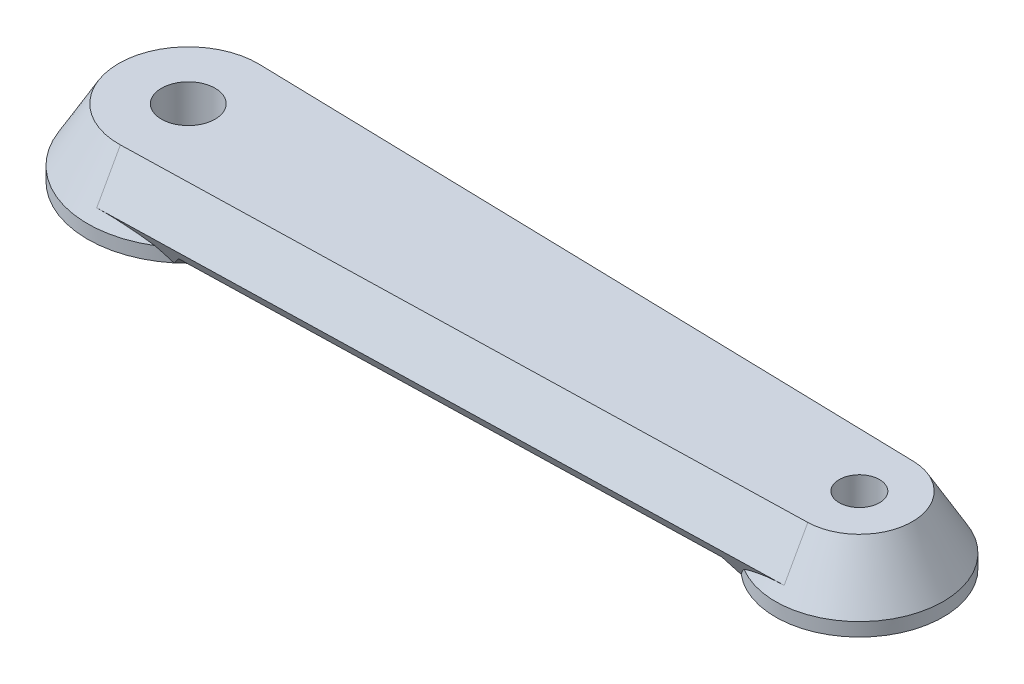
ISO-10303-21;
HEADER;
FILE_DESCRIPTION(('STEP AP214'),'2;1');
FILE_NAME('part.step','',(''),(''),'','','');
FILE_SCHEMA(('AUTOMOTIVE_DESIGN { 1 0 10303 214 1 1 1 1 }'));
ENDSEC;
DATA;
#1=APPLICATION_CONTEXT('core data for automotive mechanical design processes');
#2=APPLICATION_PROTOCOL_DEFINITION('international standard','automotive_design',2000,#1);
#3=PRODUCT_CONTEXT('',#1,'mechanical');
#4=PRODUCT('Part','Part','',(#3));
#5=PRODUCT_RELATED_PRODUCT_CATEGORY('part','',(#4));
#6=PRODUCT_DEFINITION_FORMATION('','',#4);
#7=PRODUCT_DEFINITION_CONTEXT('part definition',#1,'design');
#8=PRODUCT_DEFINITION('design','',#6,#7);
#9=PRODUCT_DEFINITION_SHAPE('','',#8);
#10=(LENGTH_UNIT() NAMED_UNIT(*) SI_UNIT(.MILLI.,.METRE.));
#11=(NAMED_UNIT(*) PLANE_ANGLE_UNIT() SI_UNIT($,.RADIAN.));
#12=(NAMED_UNIT(*) SI_UNIT($,.STERADIAN.) SOLID_ANGLE_UNIT());
#13=UNCERTAINTY_MEASURE_WITH_UNIT(LENGTH_MEASURE(1.E-05),#10,'distance_accuracy_value','');
#14=(GEOMETRIC_REPRESENTATION_CONTEXT(3) GLOBAL_UNCERTAINTY_ASSIGNED_CONTEXT((#13)) GLOBAL_UNIT_ASSIGNED_CONTEXT((#10,
#11,#12)) REPRESENTATION_CONTEXT('',''));
#15=CARTESIAN_POINT('',(0.,0.,0.));
#16=DIRECTION('',(0.,0.,1.));
#17=DIRECTION('',(1.,0.,0.));
#18=AXIS2_PLACEMENT_3D('',#15,#16,#17);
#19=CARTESIAN_POINT('',(0.,10.,0.));
#20=DIRECTION('',(0.,-1.,0.));
#21=DIRECTION('',(0.,0.,-1.));
#22=AXIS2_PLACEMENT_3D('',#19,#20,#21);
#23=CYLINDRICAL_SURFACE('',#22,75.);
#24=CARTESIAN_POINT('',(0.,10.,0.));
#25=DIRECTION('',(0.,1.,0.));
#26=DIRECTION('',(0.,0.,1.));
#27=AXIS2_PLACEMENT_3D('',#24,#25,#26);
#28=CIRCLE('',#27,75.);
#29=CARTESIAN_POINT('',(39.0298793608533,10.,-64.0442699784863));
#30=VERTEX_POINT('',#29);
#31=CARTESIAN_POINT('',(39.0298793608534,10.,64.0442699784863));
#32=VERTEX_POINT('',#31);
#33=EDGE_CURVE('E255',#30,#32,#28,.T.);
#34=ORIENTED_EDGE('',*,*,#33,.F.);
#35=CARTESIAN_POINT('',(0.,-102.583302491977,0.));
#36=DIRECTION('',(0.021650635094611,-0.500000000000001,-0.865754728546139));
#37=DIRECTION('',(-0.0125,-0.866025403784438,0.499843725578306));
#38=AXIS2_PLACEMENT_3D('',#35,#36,#37);
#39=ELLIPSE('',#38,150.,75.);
#40=CARTESIAN_POINT('',(47.4795619070681,0.,-58.0576541130702));
#41=VERTEX_POINT('',#40);
#42=EDGE_CURVE('E64',#30,#41,#39,.T.);
#43=ORIENTED_EDGE('',*,*,#42,.T.);
#44=CARTESIAN_POINT('',(0.,0.,0.));
#45=DIRECTION('',(0.,1.,0.));
#46=DIRECTION('',(0.,0.,1.));
#47=AXIS2_PLACEMENT_3D('',#44,#45,#46);
#48=CIRCLE('',#47,75.);
#49=CARTESIAN_POINT('',(47.4795619070682,0.,58.05765411307));
#50=VERTEX_POINT('',#49);
#51=EDGE_CURVE('E152',#41,#50,#48,.T.);
#52=ORIENTED_EDGE('',*,*,#51,.T.);
#53=CARTESIAN_POINT('',(0.,-102.583302491977,0.));
#54=DIRECTION('',(0.021650635094611,-0.500000000000001,0.865754728546139));
#55=DIRECTION('',(-0.0125,-0.866025403784438,-0.499843725578306));
#56=AXIS2_PLACEMENT_3D('',#53,#54,#55);
#57=ELLIPSE('',#56,150.,75.);
#58=EDGE_CURVE('E258',#50,#32,#57,.T.);
#59=ORIENTED_EDGE('',*,*,#58,.T.);
#60=EDGE_LOOP('',(#34,#43,#52,#59));
#61=FACE_BOUND('',#60,.T.);
#62=ADVANCED_FACE('F42',(#61),#23,.T.);
#63=CARTESIAN_POINT('',(0.,0.,0.));
#64=DIRECTION('',(0.,1.,0.));
#65=DIRECTION('',(0.,0.,1.));
#66=AXIS2_PLACEMENT_3D('',#63,#64,#65);
#67=PLANE('',#66);
#68=CARTESIAN_POINT('',(0.,0.,0.));
#69=DIRECTION('',(0.,1.,0.));
#70=DIRECTION('',(0.,0.,1.));
#71=AXIS2_PLACEMENT_3D('',#68,#69,#70);
#72=CIRCLE('',#71,20.);
#73=CARTESIAN_POINT('',(0.,0.,20.));
#74=VERTEX_POINT('',#73);
#75=EDGE_CURVE('E173',#74,#74,#72,.T.);
#76=ORIENTED_EDGE('',*,*,#75,.T.);
#77=EDGE_LOOP('',(#76));
#78=FACE_BOUND('',#77,.T.);
#79=EDGE_CURVE('E155',#50,#41,#48,.T.);
#80=ORIENTED_EDGE('',*,*,#79,.F.);
#81=ORIENTED_EDGE('',*,*,#51,.F.);
#82=EDGE_LOOP('',(#80,#81));
#83=FACE_BOUND('',#82,.T.);
#84=ADVANCED_FACE('F248',(#78,#83),#67,.F.);
#85=CARTESIAN_POINT('',(0.,10.,0.));
#86=DIRECTION('',(0.,1.,0.));
#87=DIRECTION('',(0.,0.,1.));
#88=AXIS2_PLACEMENT_3D('',#85,#86,#87);
#89=PLANE('',#88);
#90=DIRECTION('',(0.99968745115661,0.,0.025));
#91=VECTOR('',#90,1.);
#92=CARTESIAN_POINT('',(1.625,10.,-64.9796843251797));
#93=LINE('',#92,#91);
#94=CARTESIAN_POINT('',(56.3801367453318,10.,-63.6103779314168));
#95=VERTEX_POINT('',#94);
#96=CARTESIAN_POINT('',(451.328127442169,10.,-53.7335911857221));
#97=VERTEX_POINT('',#96);
#98=EDGE_CURVE('E176',#95,#97,#93,.T.);
#99=ORIENTED_EDGE('',*,*,#98,.T.);
#100=CARTESIAN_POINT('',(500.,10.,0.));
#101=DIRECTION('',(0.,1.,0.));
#102=DIRECTION('',(0.,0.,1.));
#103=AXIS2_PLACEMENT_3D('',#100,#101,#102);
#104=CIRCLE('',#103,72.5000000000001);
#105=CARTESIAN_POINT('',(451.328127442169,10.,53.7335911857221));
#106=VERTEX_POINT('',#105);
#107=EDGE_CURVE('E298',#97,#106,#104,.T.);
#108=ORIENTED_EDGE('',*,*,#107,.T.);
#109=DIRECTION('',(-0.99968745115661,0.,0.025));
#110=VECTOR('',#109,1.);
#111=CARTESIAN_POINT('',(1.625,10.,64.9796843251797));
#112=LINE('',#111,#110);
#113=CARTESIAN_POINT('',(56.3801367453318,10.,63.6103779314168));
#114=VERTEX_POINT('',#113);
#115=EDGE_CURVE('E179',#106,#114,#112,.T.);
#116=ORIENTED_EDGE('',*,*,#115,.T.);
#117=CARTESIAN_POINT('',(0.,10.,0.));
#118=DIRECTION('',(0.,1.,0.));
#119=DIRECTION('',(0.,0.,1.));
#120=AXIS2_PLACEMENT_3D('',#117,#118,#119);
#121=CIRCLE('',#120,85.);
#122=EDGE_CURVE('E263',#114,#95,#121,.T.);
#123=ORIENTED_EDGE('',*,*,#122,.T.);
#124=EDGE_LOOP('',(#99,#108,#116,#123));
#125=FACE_BOUND('',#124,.T.);
#126=ADVANCED_FACE('F253',(#125),#89,.F.);
#127=CARTESIAN_POINT('',(0.,10.,0.));
#128=DIRECTION('',(0.,-1.,0.));
#129=DIRECTION('',(0.,0.,1.));
#130=AXIS2_PLACEMENT_3D('',#127,#128,#129);
#131=CONICAL_SURFACE('',#130,75.,0.5235987755983);
#132=ORIENTED_EDGE('',*,*,#33,.T.);
#133=CARTESIAN_POINT('',(39.0298793608534,10.,64.0442699784863));
#134=CARTESIAN_POINT('',(38.0966256087769,10.43505847696,64.3188682764547));
#135=CARTESIAN_POINT('',(37.1552648024323,10.8573881594754,64.5863180436157));
#136=CARTESIAN_POINT('',(35.2564715687795,11.6748710838556,65.1059242632289));
#137=CARTESIAN_POINT('',(34.2990365222441,12.070019842175,65.3580781917966));
#138=CARTESIAN_POINT('',(32.3670461382462,12.8318686150163,65.8463841649454));
#139=CARTESIAN_POINT('',(31.3924665298006,13.1985235117224,66.0825107595635));
#140=CARTESIAN_POINT('',(29.4282116571537,13.9008425106955,66.5372433206298));
#141=CARTESIAN_POINT('',(28.4385372148285,14.2365082932735,66.755850236956));
#142=CARTESIAN_POINT('',(26.4650644366187,14.8685273603042,67.170212943479));
#143=CARTESIAN_POINT('',(25.4815569932161,15.165542112825,67.3663434772568));
#144=CARTESIAN_POINT('',(23.5015927353855,15.7263814558718,67.7397600402976));
#145=CARTESIAN_POINT('',(22.5051362384407,15.9902068584423,67.9170465306019));
#146=CARTESIAN_POINT('',(20.5010521413008,16.4828737999921,68.2516946182277));
#147=CARTESIAN_POINT('',(19.4934330106296,16.7117401427374,68.4090703286832));
#148=CARTESIAN_POINT('',(17.4677317059169,17.1331865766022,68.7031269804082));
#149=CARTESIAN_POINT('',(16.449650514163,17.3257700420977,68.8398098459189));
#150=CARTESIAN_POINT('',(14.3090382865125,17.6895396259296,69.1034300129368));
#151=CARTESIAN_POINT('',(13.1856206567094,17.8570554407307,69.2282697729734));
#152=CARTESIAN_POINT('',(10.9303019535446,18.1456490458501,69.451342057139));
#153=CARTESIAN_POINT('',(9.79840151792611,18.2667302921437,69.5495765612516));
#154=CARTESIAN_POINT('',(7.51569345886579,18.4624542932379,69.7196987389366));
#155=CARTESIAN_POINT('',(6.36481614666029,18.5365610932669,69.7912786248978));
#156=CARTESIAN_POINT('',(4.63585984151394,18.6107395148713,69.8773563677068));
#157=CARTESIAN_POINT('',(4.05903322829362,18.6293020330475,69.9025019671312));
#158=CARTESIAN_POINT('',(2.90484242122852,18.6540608054182,69.9456647116667));
#159=CARTESIAN_POINT('',(2.32747822200494,18.6602569345219,69.9636817846686));
#160=CARTESIAN_POINT('',(1.75000000000001,18.6602540378443,69.9781215809627));
#161=B_SPLINE_CURVE_WITH_KNOTS('',3,(#133,#134,#135,#136,#137,#138,#139,#140,#141,#142,#143,
#144,#145,#146,#147,#148,#149,#150,#151,#152,#153,#154,#155,#156,#157,#158,#159,#160),
.UNSPECIFIED.,.F.,.F.,(4,2,2,2,2,2,2,2,2,2,2,2,2,4),(0.,3.19695606092177,6.39443820751428,
9.59688430844946,12.7991566622467,15.9362046485129,19.0731758656129,22.2079109305702,
25.3423543151777,28.7691052912586,32.1956011757976,35.6605194918706,37.3933850600468,
39.1262681567528),.UNSPECIFIED.);
#162=CARTESIAN_POINT('',(1.75000000000001,18.6602540378443,69.9781215809627));
#163=VERTEX_POINT('',#162);
#164=EDGE_CURVE('E151',#32,#163,#161,.T.);
#165=ORIENTED_EDGE('',*,*,#164,.T.);
#166=DIRECTION('',(0.0125,-0.866025403784438,0.499843725578306));
#167=VECTOR('',#166,1.);
#168=CARTESIAN_POINT('',(1.87500000000001,10.,74.9765588367458));
#169=LINE('',#168,#167);
#170=CARTESIAN_POINT('',(1.29764973081038,50.,51.8897660755153));
#171=VERTEX_POINT('',#170);
#172=EDGE_CURVE('E130',#171,#163,#169,.T.);
#173=ORIENTED_EDGE('',*,*,#172,.F.);
#174=CARTESIAN_POINT('',(0.,50.,0.));
#175=DIRECTION('',(0.,1.,0.));
#176=DIRECTION('',(0.,0.,1.));
#177=AXIS2_PLACEMENT_3D('',#174,#175,#176);
#178=CIRCLE('',#177,51.9059892324149);
#179=CARTESIAN_POINT('',(1.29764973081036,50.,-51.8897660755153));
#180=VERTEX_POINT('',#179);
#181=EDGE_CURVE('E137',#180,#171,#178,.T.);
#182=ORIENTED_EDGE('',*,*,#181,.F.);
#183=DIRECTION('',(0.0124999999999999,-0.866025403784438,-0.499843725578306));
#184=VECTOR('',#183,1.);
#185=CARTESIAN_POINT('',(1.87499999999998,10.,-74.9765588367458));
#186=LINE('',#185,#184);
#187=CARTESIAN_POINT('',(1.74999999999998,18.6602540378443,-69.9781215809627));
#188=VERTEX_POINT('',#187);
#189=EDGE_CURVE('E162',#180,#188,#186,.T.);
#190=ORIENTED_EDGE('',*,*,#189,.T.);
#191=CARTESIAN_POINT('',(1.74999999999998,18.6602540378443,-69.9781215809627));
#192=CARTESIAN_POINT('',(2.2495150492895,18.6602556728977,-69.9656307447326));
#193=CARTESIAN_POINT('',(2.74894743623502,18.6556203138964,-69.9504639689335));
#194=CARTESIAN_POINT('',(3.74744783227952,18.6370932781913,-69.9147937212861));
#195=CARTESIAN_POINT('',(4.24651584285561,18.6232016392216,-69.8942902711935));
#196=CARTESIAN_POINT('',(5.74276793969893,18.5676729409658,-69.8248027416397));
#197=CARTESIAN_POINT('',(6.73911324642626,18.5121820924751,-69.7678386485965));
#198=CARTESIAN_POINT('',(8.72692473547793,18.364707601232,-69.6329567669762));
#199=CARTESIAN_POINT('',(9.71839386637799,18.2727497556149,-69.5550538033015));
#200=CARTESIAN_POINT('',(11.6955200761154,18.0529921857793,-69.3786934347277));
#201=CARTESIAN_POINT('',(12.6811771285954,17.9251922991475,-69.2802359366893));
#202=CARTESIAN_POINT('',(14.6278034017393,17.6371866478731,-69.0652229375051));
#203=CARTESIAN_POINT('',(15.5889017670897,17.4775909762614,-68.9490165542342));
#204=CARTESIAN_POINT('',(17.5026301489284,17.1256679134164,-68.6979119871786));
#205=CARTESIAN_POINT('',(18.4552600342228,16.9333400160211,-68.5630135143507));
#206=CARTESIAN_POINT('',(20.3508169928094,16.5171214539281,-68.2752307453483));
#207=CARTESIAN_POINT('',(21.2937443552694,16.2932317328192,-68.122346986894));
#208=CARTESIAN_POINT('',(23.168844201399,15.8151773362009,-67.7993637081156));
#209=CARTESIAN_POINT('',(24.1010171258474,15.561013906352,-67.6292648961761));
#210=CARTESIAN_POINT('',(26.2301613169441,14.9436152391468,-67.2194529184308));
#211=CARTESIAN_POINT('',(27.4231836622604,14.5704587379947,-66.9741086713472));
#212=CARTESIAN_POINT('',(29.7880452461698,13.7785327805174,-66.4576070350326));
#213=CARTESIAN_POINT('',(30.9598875480888,13.3597699829101,-66.1864534148091));
#214=CARTESIAN_POINT('',(33.2952391887912,12.474522960917,-65.6167939709442));
#215=CARTESIAN_POINT('',(34.4584870310655,12.0075339319938,-65.3180031466033));
#216=CARTESIAN_POINT('',(36.7617464496265,11.033224328476,-64.6977098773304));
#217=CARTESIAN_POINT('',(37.9017593372312,10.5259060379188,-64.376208718707));
#218=CARTESIAN_POINT('',(39.0298793608534,10.,-64.0442699784863));
#219=B_SPLINE_CURVE_WITH_KNOTS('',3,(#191,#192,#193,#194,#195,#196,#197,#198,#199,#200,#201,
#202,#203,#204,#205,#206,#207,#208,#209,#210,#211,#212,#213,#214,#215,#216,#217,#218),
.UNSPECIFIED.,.F.,.F.,(4,2,2,2,2,2,2,2,2,2,2,2,2,4),(0.,1.49895361057675,2.9979011105484,
5.99545681952691,8.99089579811997,11.9863483503418,14.9290677655218,17.8718326902287,
20.8145096551453,23.7570655806543,27.5772932701795,31.3969639356934,35.2617067386256,
39.1262308185799),.UNSPECIFIED.);
#220=EDGE_CURVE('E260',#188,#30,#219,.T.);
#221=ORIENTED_EDGE('',*,*,#220,.T.);
#222=EDGE_LOOP('',(#132,#165,#173,#182,#190,#221));
#223=FACE_BOUND('',#222,.T.);
#224=ADVANCED_FACE('F149',(#223),#131,.T.);
#225=CARTESIAN_POINT('',(1.87500000000001,10.,74.9765588367458));
#226=DIRECTION('',(0.021650635094611,0.500000000000001,0.865754728546139));
#227=DIRECTION('',(0.,-0.86595771117451,0.500117228714831));
#228=AXIS2_PLACEMENT_3D('',#225,#226,#227);
#229=PLANE('',#228);
#230=ORIENTED_EDGE('',*,*,#172,.T.);
#231=DIRECTION('',(-0.99968745115661,0.,0.025));
#232=VECTOR('',#231,1.);
#233=CARTESIAN_POINT('',(1.75000000000001,18.6602540378443,69.9781215809627));
#234=LINE('',#233,#232);
#235=CARTESIAN_POINT('',(501.4375,18.6602540378443,57.4820284415051));
#236=VERTEX_POINT('',#235);
#237=EDGE_CURVE('E169',#163,#236,#234,.F.);
#238=ORIENTED_EDGE('',*,*,#237,.T.);
#239=DIRECTION('',(0.0125000000000002,-0.866025403784438,0.499843725578306));
#240=VECTOR('',#239,1.);
#241=CARTESIAN_POINT('',(501.5625,10.,62.4804656972881));
#242=LINE('',#241,#240);
#243=CARTESIAN_POINT('',(500.98514973081,50.,39.3936729360577));
#244=VERTEX_POINT('',#243);
#245=EDGE_CURVE('E133',#244,#236,#242,.T.);
#246=ORIENTED_EDGE('',*,*,#245,.F.);
#247=DIRECTION('',(-0.99968745115661,0.,0.025));
#248=VECTOR('',#247,1.);
#249=CARTESIAN_POINT('',(1.29764973081038,50.,51.8897660755153));
#250=LINE('',#249,#248);
#251=EDGE_CURVE('E125',#171,#244,#250,.F.);
#252=ORIENTED_EDGE('',*,*,#251,.F.);
#253=EDGE_LOOP('',(#230,#238,#246,#252));
#254=FACE_BOUND('',#253,.T.);
#255=ADVANCED_FACE('F127',(#254),#229,.T.);
#256=CARTESIAN_POINT('',(500.,10.,0.));
#257=DIRECTION('',(0.,-1.,0.));
#258=DIRECTION('',(0.,0.,1.));
#259=AXIS2_PLACEMENT_3D('',#256,#257,#258);
#260=CONICAL_SURFACE('',#259,62.5,0.5235987755983);
#261=CARTESIAN_POINT('',(500.,10.,0.));
#262=DIRECTION('',(0.,1.,0.));
#263=DIRECTION('',(0.,0.,1.));
#264=AXIS2_PLACEMENT_3D('',#261,#262,#263);
#265=CIRCLE('',#264,62.5);
#266=CARTESIAN_POINT('',(467.411449131332,10.,53.3313824336128));
#267=VERTEX_POINT('',#266);
#268=CARTESIAN_POINT('',(467.411449131332,10.,-53.3313824336127));
#269=VERTEX_POINT('',#268);
#270=EDGE_CURVE('E146',#267,#269,#265,.T.);
#271=ORIENTED_EDGE('',*,*,#270,.T.);
#272=CARTESIAN_POINT('',(467.411449131332,10.,-53.3313824336127));
#273=CARTESIAN_POINT('',(468.181400032664,10.390486632535,-53.537645690831));
#274=CARTESIAN_POINT('',(468.957812492336,10.7711624197198,-53.7380812934601));
#275=CARTESIAN_POINT('',(470.523834916271,11.511600901294,-54.1265445032438));
#276=CARTESIAN_POINT('',(471.313447986054,11.8713585828353,-54.3145691376621));
#277=CARTESIAN_POINT('',(473.703955418983,12.9179239741499,-54.8592114895761));
#278=CARTESIAN_POINT('',(475.324572732167,13.5710301600044,-55.1958723119097));
#279=CARTESIAN_POINT('',(477.773929529012,14.4671043659098,-55.6521296786942));
#280=CARTESIAN_POINT('',(478.58434497421,14.7491738533315,-55.7947667681146));
#281=CARTESIAN_POINT('',(480.216280263219,15.2872961443724,-56.0647378146172));
#282=CARTESIAN_POINT('',(481.037799234512,15.5433509789145,-56.1920729664395));
#283=CARTESIAN_POINT('',(482.690761231717,16.0278483966865,-56.4305481662295));
#284=CARTESIAN_POINT('',(483.522198395636,16.2563064805984,-56.5416973129139));
#285=CARTESIAN_POINT('',(485.194479268091,16.6843603071251,-56.7470914787844));
#286=CARTESIAN_POINT('',(486.035322389566,16.8839578403265,-56.8413375467704));
#287=CARTESIAN_POINT('',(488.06166398151,17.3264024707131,-57.0461885593741));
#288=CARTESIAN_POINT('',(489.251199334364,17.5548661393843,-57.1483856777512));
#289=CARTESIAN_POINT('',(491.643100122199,17.9496205345182,-57.3165522746251));
#290=CARTESIAN_POINT('',(492.845464724788,18.1159152697184,-57.3825240891073));
#291=CARTESIAN_POINT('',(494.664541029738,18.3179100179609,-57.4536911469379));
#292=CARTESIAN_POINT('',(495.278151138526,18.3775979473472,-57.4728177143032));
#293=CARTESIAN_POINT('',(496.507024636348,18.4801027434725,-57.5012859462068));
#294=CARTESIAN_POINT('',(497.122288017682,18.522919688641,-57.510627656233));
#295=CARTESIAN_POINT('',(498.354027637161,18.5915092422186,-57.5194371163543));
#296=CARTESIAN_POINT('',(498.97050419906,18.6172764203271,-57.5189017221871));
#297=CARTESIAN_POINT('',(500.203860286034,18.6516551170028,-57.5079129352602));
#298=CARTESIAN_POINT('',(500.820739819676,18.6602662581603,-57.4974593243205));
#299=CARTESIAN_POINT('',(501.4375,18.6602540378443,-57.4820284415051));
#300=B_SPLINE_CURVE_WITH_KNOTS('',3,(#272,#273,#274,#275,#276,#277,#278,#279,#280,#281,#282,
#283,#284,#285,#286,#287,#288,#289,#290,#291,#292,#293,#294,#295,#296,#297,#298,#299),
.UNSPECIFIED.,.F.,.F.,(4,2,2,2,2,2,2,2,2,2,2,2,2,4),(0.,2.66257234451498,5.32578014442944,
10.6589244099262,13.2680887103055,15.8770491605733,18.4845373147377,21.0918636238017,
24.7364480886076,28.3807975050989,30.2309466806849,32.0810872552293,33.9318168108292,
35.7825870795399),.UNSPECIFIED.);
#301=CARTESIAN_POINT('',(501.4375,18.6602540378443,-57.4820284415051));
#302=VERTEX_POINT('',#301);
#303=EDGE_CURVE('E262',#269,#302,#300,.T.);
#304=ORIENTED_EDGE('',*,*,#303,.T.);
#305=DIRECTION('',(0.0125,-0.866025403784438,-0.499843725578306));
#306=VECTOR('',#305,1.);
#307=CARTESIAN_POINT('',(501.5625,10.,-62.4804656972882));
#308=LINE('',#307,#306);
#309=CARTESIAN_POINT('',(500.98514973081,50.,-39.3936729360577));
#310=VERTEX_POINT('',#309);
#311=EDGE_CURVE('E157',#310,#302,#308,.T.);
#312=ORIENTED_EDGE('',*,*,#311,.F.);
#313=CARTESIAN_POINT('',(500.,50.,0.));
#314=DIRECTION('',(0.,1.,0.));
#315=DIRECTION('',(0.,0.,1.));
#316=AXIS2_PLACEMENT_3D('',#313,#314,#315);
#317=CIRCLE('',#316,39.4059892324149);
#318=EDGE_CURVE('E136',#244,#310,#317,.T.);
#319=ORIENTED_EDGE('',*,*,#318,.F.);
#320=ORIENTED_EDGE('',*,*,#245,.T.);
#321=CARTESIAN_POINT('',(501.4375,18.6602540378443,57.4820284415051));
#322=CARTESIAN_POINT('',(500.61630085616,18.6602934925674,57.5025876250452));
#323=CARTESIAN_POINT('',(499.794891472621,18.6450106399218,57.5143029621598));
#324=CARTESIAN_POINT('',(498.153183859666,18.5840874747937,57.5201734815211));
#325=CARTESIAN_POINT('',(497.332885566588,18.5384489822814,57.5143297164486));
#326=CARTESIAN_POINT('',(495.695476646422,18.4171493135982,57.4852234459548));
#327=CARTESIAN_POINT('',(494.878364020743,18.3415117612519,57.4619746339994));
#328=CARTESIAN_POINT('',(493.248076298084,18.1607619477929,57.3983559896757));
#329=CARTESIAN_POINT('',(492.434901226126,18.0556494996134,57.3579860486447));
#330=CARTESIAN_POINT('',(490.829148244715,17.8189311778649,57.2614303080113));
#331=CARTESIAN_POINT('',(490.036471766179,17.6878643060379,57.2055582635006));
#332=CARTESIAN_POINT('',(488.457292641607,17.3988845302534,57.0781553706486));
#333=CARTESIAN_POINT('',(487.670790096219,17.2409711895901,57.0066242675791));
#334=CARTESIAN_POINT('',(486.104944805044,16.8992441949778,56.8484247824637));
#335=CARTESIAN_POINT('',(485.325602300417,16.7154296720189,56.7617558925067));
#336=CARTESIAN_POINT('',(483.775016953575,16.322965300597,56.5738723929195));
#337=CARTESIAN_POINT('',(483.003773966041,16.1143158985428,56.4726580447382));
#338=CARTESIAN_POINT('',(480.956098295885,15.5254657349203,56.1837868496543));
#339=CARTESIAN_POINT('',(479.687471346719,15.1240029746197,55.9836553397824));
#340=CARTESIAN_POINT('',(477.177514213064,14.2602821121631,55.5475985066209));
#341=CARTESIAN_POINT('',(475.936184468531,13.7980230309759,55.3116726069084));
#342=CARTESIAN_POINT('',(473.462339732786,12.8101345483181,54.8030020595189));
#343=CARTESIAN_POINT('',(472.230302800994,12.283590563581,54.5297172566365));
#344=CARTESIAN_POINT('',(469.79742633347,11.1790458073497,53.952649594152));
#345=CARTESIAN_POINT('',(468.596573815309,10.6010669072669,53.6488796906253));
#346=CARTESIAN_POINT('',(467.411449131332,9.99999999999999,53.3313824336127));
#347=B_SPLINE_CURVE_WITH_KNOTS('',3,(#321,#322,#323,#324,#325,#326,#327,#328,#329,#330,#331,
#332,#333,#334,#335,#336,#337,#338,#339,#340,#341,#342,#343,#344,#345,#346),.UNSPECIFIED.,.F.,
.F.,(4,2,2,2,2,2,2,2,2,2,2,2,4),(0.,2.46416246716391,4.92817720896451,7.39025541531648,
9.85234924797391,12.26785061702,14.6833912822724,17.0990130105823,19.5145913244638,
23.5489355919643,27.58334483433,31.6838881974717,35.7826961635627),.UNSPECIFIED.);
#348=EDGE_CURVE('E185',#236,#267,#347,.T.);
#349=ORIENTED_EDGE('',*,*,#348,.T.);
#350=EDGE_LOOP('',(#271,#304,#312,#319,#320,#349));
#351=FACE_BOUND('',#350,.T.);
#352=ADVANCED_FACE('F199',(#351),#260,.T.);
#353=CARTESIAN_POINT('',(1.875,10.,-74.9765588367458));
#354=DIRECTION('',(0.021650635094611,0.500000000000001,-0.865754728546139));
#355=DIRECTION('',(0.,0.86595771117451,0.500117228714831));
#356=AXIS2_PLACEMENT_3D('',#353,#354,#355);
#357=PLANE('',#356);
#358=ORIENTED_EDGE('',*,*,#311,.T.);
#359=DIRECTION('',(0.99968745115661,0.,0.025));
#360=VECTOR('',#359,1.);
#361=CARTESIAN_POINT('',(1.75,18.6602540378443,-69.9781215809627));
#362=LINE('',#361,#360);
#363=EDGE_CURVE('E182',#302,#188,#362,.F.);
#364=ORIENTED_EDGE('',*,*,#363,.T.);
#365=ORIENTED_EDGE('',*,*,#189,.F.);
#366=DIRECTION('',(0.99968745115661,0.,0.025));
#367=VECTOR('',#366,1.);
#368=CARTESIAN_POINT('',(1.29764973081037,50.,-51.8897660755153));
#369=LINE('',#368,#367);
#370=EDGE_CURVE('E142',#310,#180,#369,.F.);
#371=ORIENTED_EDGE('',*,*,#370,.F.);
#372=EDGE_LOOP('',(#358,#364,#365,#371));
#373=FACE_BOUND('',#372,.T.);
#374=ADVANCED_FACE('F278',(#373),#357,.T.);
#375=CARTESIAN_POINT('',(0.,50.,0.));
#376=DIRECTION('',(0.,1.,0.));
#377=DIRECTION('',(0.,0.,1.));
#378=AXIS2_PLACEMENT_3D('',#375,#376,#377);
#379=PLANE('',#378);
#380=CARTESIAN_POINT('',(0.,50.,0.));
#381=DIRECTION('',(0.,-1.,0.));
#382=DIRECTION('',(0.,0.,-1.));
#383=AXIS2_PLACEMENT_3D('',#380,#381,#382);
#384=CIRCLE('',#383,20.);
#385=CARTESIAN_POINT('',(0.,50.,-20.));
#386=VERTEX_POINT('',#385);
#387=EDGE_CURVE('E174',#386,#386,#384,.T.);
#388=ORIENTED_EDGE('',*,*,#387,.T.);
#389=EDGE_LOOP('',(#388));
#390=FACE_BOUND('',#389,.T.);
#391=CARTESIAN_POINT('',(500.,50.,0.));
#392=DIRECTION('',(0.,-1.,0.));
#393=DIRECTION('',(0.,0.,-1.));
#394=AXIS2_PLACEMENT_3D('',#391,#392,#393);
#395=CIRCLE('',#394,15.);
#396=CARTESIAN_POINT('',(500.,50.,-15.));
#397=VERTEX_POINT('',#396);
#398=EDGE_CURVE('E322',#397,#397,#395,.T.);
#399=ORIENTED_EDGE('',*,*,#398,.T.);
#400=EDGE_LOOP('',(#399));
#401=FACE_BOUND('',#400,.T.);
#402=ORIENTED_EDGE('',*,*,#181,.T.);
#403=ORIENTED_EDGE('',*,*,#251,.T.);
#404=ORIENTED_EDGE('',*,*,#318,.T.);
#405=ORIENTED_EDGE('',*,*,#370,.T.);
#406=EDGE_LOOP('',(#402,#403,#404,#405));
#407=FACE_BOUND('',#406,.T.);
#408=ADVANCED_FACE('F140',(#390,#401,#407),#379,.T.);
#409=CARTESIAN_POINT('',(500.,10.,0.));
#410=DIRECTION('',(0.,-1.,0.));
#411=DIRECTION('',(0.,0.,-1.));
#412=AXIS2_PLACEMENT_3D('',#409,#410,#411);
#413=CYLINDRICAL_SURFACE('',#412,62.5);
#414=ORIENTED_EDGE('',*,*,#270,.F.);
#415=CARTESIAN_POINT('',(500.,-80.9326673973659,0.));
#416=DIRECTION('',(0.021650635094611,-0.500000000000001,0.865754728546139));
#417=DIRECTION('',(-0.0125,-0.866025403784438,-0.499843725578306));
#418=AXIS2_PLACEMENT_3D('',#415,#416,#417);
#419=ELLIPSE('',#418,125.,62.5);
#420=CARTESIAN_POINT('',(459.673492334786,0.,47.7495840770097));
#421=VERTEX_POINT('',#420);
#422=EDGE_CURVE('E72',#267,#421,#419,.T.);
#423=ORIENTED_EDGE('',*,*,#422,.T.);
#424=CARTESIAN_POINT('',(500.,0.,0.));
#425=DIRECTION('',(0.,1.,0.));
#426=DIRECTION('',(0.,0.,1.));
#427=AXIS2_PLACEMENT_3D('',#424,#425,#426);
#428=CIRCLE('',#427,62.5);
#429=CARTESIAN_POINT('',(459.673492334786,0.,-47.7495840770097));
#430=VERTEX_POINT('',#429);
#431=EDGE_CURVE('E296',#421,#430,#428,.T.);
#432=ORIENTED_EDGE('',*,*,#431,.T.);
#433=CARTESIAN_POINT('',(500.,-80.9326673973659,0.));
#434=DIRECTION('',(0.021650635094611,-0.500000000000001,-0.865754728546139));
#435=DIRECTION('',(-0.0125,-0.866025403784438,0.499843725578306));
#436=AXIS2_PLACEMENT_3D('',#433,#434,#435);
#437=ELLIPSE('',#436,125.,62.5);
#438=EDGE_CURVE('E291',#430,#269,#437,.T.);
#439=ORIENTED_EDGE('',*,*,#438,.T.);
#440=EDGE_LOOP('',(#414,#423,#432,#439));
#441=FACE_BOUND('',#440,.T.);
#442=ADVANCED_FACE('F286',(#441),#413,.T.);
#443=CARTESIAN_POINT('',(500.,0.,0.));
#444=DIRECTION('',(0.,1.,0.));
#445=DIRECTION('',(0.,0.,1.));
#446=AXIS2_PLACEMENT_3D('',#443,#444,#445);
#447=PLANE('',#446);
#448=CARTESIAN_POINT('',(500.,0.,0.));
#449=DIRECTION('',(0.,1.,0.));
#450=DIRECTION('',(0.,0.,1.));
#451=AXIS2_PLACEMENT_3D('',#448,#449,#450);
#452=CIRCLE('',#451,15.);
#453=CARTESIAN_POINT('',(500.,0.,15.));
#454=VERTEX_POINT('',#453);
#455=EDGE_CURVE('E170',#454,#454,#452,.T.);
#456=ORIENTED_EDGE('',*,*,#455,.T.);
#457=EDGE_LOOP('',(#456));
#458=FACE_BOUND('',#457,.T.);
#459=EDGE_CURVE('E259',#430,#421,#428,.T.);
#460=ORIENTED_EDGE('',*,*,#459,.F.);
#461=ORIENTED_EDGE('',*,*,#431,.F.);
#462=EDGE_LOOP('',(#460,#461));
#463=FACE_BOUND('',#462,.T.);
#464=ADVANCED_FACE('F337',(#458,#463),#447,.F.);
#465=CARTESIAN_POINT('',(500.,50.,0.));
#466=DIRECTION('',(0.,-1.,0.));
#467=DIRECTION('',(0.,0.,-1.));
#468=AXIS2_PLACEMENT_3D('',#465,#466,#467);
#469=CYLINDRICAL_SURFACE('',#468,15.);
#470=ORIENTED_EDGE('',*,*,#398,.F.);
#471=EDGE_LOOP('',(#470));
#472=FACE_BOUND('',#471,.T.);
#473=ORIENTED_EDGE('',*,*,#455,.F.);
#474=EDGE_LOOP('',(#473));
#475=FACE_BOUND('',#474,.T.);
#476=ADVANCED_FACE('F331',(#472,#475),#469,.F.);
#477=CARTESIAN_POINT('',(0.,50.,0.));
#478=DIRECTION('',(0.,-1.,0.));
#479=DIRECTION('',(0.,0.,-1.));
#480=AXIS2_PLACEMENT_3D('',#477,#478,#479);
#481=CYLINDRICAL_SURFACE('',#480,20.);
#482=ORIENTED_EDGE('',*,*,#387,.F.);
#483=EDGE_LOOP('',(#482));
#484=FACE_BOUND('',#483,.T.);
#485=ORIENTED_EDGE('',*,*,#75,.F.);
#486=EDGE_LOOP('',(#485));
#487=FACE_BOUND('',#486,.T.);
#488=ADVANCED_FACE('F213',(#484,#487),#481,.F.);
#489=CARTESIAN_POINT('',(1.75000000000001,18.6602540378443,69.9781215809627));
#490=DIRECTION('',(0.021650635094611,-0.500000000000001,0.865754728546139));
#491=DIRECTION('',(-0.99968745115661,0.,0.025));
#492=AXIS2_PLACEMENT_3D('',#489,#490,#491);
#493=PLANE('',#492);
#494=ORIENTED_EDGE('',*,*,#164,.F.);
#495=ORIENTED_EDGE('',*,*,#58,.F.);
#496=CARTESIAN_POINT('',(47.4795619070681,1.97758476261356E-13,58.0576541130702));
#497=CARTESIAN_POINT('',(48.2269552561639,0.82955601497632,58.518057566464));
#498=CARTESIAN_POINT('',(48.9726974208842,1.66021948287701,58.9791419005197));
#499=CARTESIAN_POINT('',(50.4612320179051,3.32350459250783,59.9025152406481));
#500=CARTESIAN_POINT('',(51.2040244723994,4.15612621942933,60.3648042376133));
#501=CARTESIAN_POINT('',(52.6870225003576,5.82308225793724,61.2904361096452));
#502=CARTESIAN_POINT('',(53.4272280774567,6.65741666711421,61.7537789832294));
#503=CARTESIAN_POINT('',(54.9053389963792,8.32761271778634,62.6814042779243));
#504=CARTESIAN_POINT('',(55.6432443208366,9.16347437073651,63.1456867060849));
#505=CARTESIAN_POINT('',(56.3801367453318,10.,63.6103779314168));
#506=B_SPLINE_CURVE_WITH_KNOTS('',3,(#496,#497,#498,#499,#500,#501,#502,#503,#504,#505),
.UNSPECIFIED.,.F.,.F.,(4,2,2,2,4),(0.,3.62333442131014,7.24664152858923,10.869943542261,
14.4932728447951),.UNSPECIFIED.);
#507=EDGE_CURVE('E11',#50,#114,#506,.T.);
#508=ORIENTED_EDGE('',*,*,#507,.T.);
#509=ORIENTED_EDGE('',*,*,#115,.F.);
#510=CARTESIAN_POINT('',(451.328127442169,10.,53.7335911857221));
#511=CARTESIAN_POINT('',(452.020596014461,9.16478869383626,53.2339138253899));
#512=CARTESIAN_POINT('',(452.713678294827,8.32996202989799,52.7344432602819));
#513=CARTESIAN_POINT('',(454.101257614731,6.66120233943835,51.7359828531392));
#514=CARTESIAN_POINT('',(454.795754650286,5.82726931041123,51.236993009757));
#515=CARTESIAN_POINT('',(456.18635513594,4.16041604066818,50.239558066492));
#516=CARTESIAN_POINT('',(456.882458587012,3.32749580056566,49.7411129669392));
#517=CARTESIAN_POINT('',(458.276521710814,1.66282768369764,48.744853423691));
#518=CARTESIAN_POINT('',(458.974481388764,0.831079810238799,48.2470389817749));
#519=CARTESIAN_POINT('',(459.673492334786,0.,47.7495840770097));
#520=B_SPLINE_CURVE_WITH_KNOTS('',3,(#510,#511,#512,#513,#514,#515,#516,#517,#518,#519),
.UNSPECIFIED.,.F.,.F.,(4,2,2,2,4),(0.,3.58342219284233,7.16683431135262,10.7502485991071,
14.3336729737727),.UNSPECIFIED.);
#521=EDGE_CURVE('E220',#106,#421,#520,.T.);
#522=ORIENTED_EDGE('',*,*,#521,.T.);
#523=ORIENTED_EDGE('',*,*,#422,.F.);
#524=ORIENTED_EDGE('',*,*,#348,.F.);
#525=ORIENTED_EDGE('',*,*,#237,.F.);
#526=EDGE_LOOP('',(#494,#495,#508,#509,#522,#523,#524,#525));
#527=FACE_BOUND('',#526,.T.);
#528=ADVANCED_FACE('F204',(#527),#493,.T.);
#529=CARTESIAN_POINT('',(1.75,18.6602540378443,-69.9781215809627));
#530=DIRECTION('',(0.021650635094611,-0.500000000000001,-0.865754728546139));
#531=DIRECTION('',(0.99968745115661,0.,0.025));
#532=AXIS2_PLACEMENT_3D('',#529,#530,#531);
#533=PLANE('',#532);
#534=ORIENTED_EDGE('',*,*,#303,.F.);
#535=ORIENTED_EDGE('',*,*,#438,.F.);
#536=CARTESIAN_POINT('',(459.673492334786,0.,-47.7495840770097));
#537=CARTESIAN_POINT('',(458.974481388764,0.831079810238792,-48.2470389817748));
#538=CARTESIAN_POINT('',(458.276521710814,1.66282768369763,-48.744853423691));
#539=CARTESIAN_POINT('',(456.882458587012,3.32749580056567,-49.7411129669392));
#540=CARTESIAN_POINT('',(456.18635513594,4.16041604066819,-50.239558066492));
#541=CARTESIAN_POINT('',(454.795754650286,5.82726931041123,-51.236993009757));
#542=CARTESIAN_POINT('',(454.101257614731,6.66120233943835,-51.7359828531392));
#543=CARTESIAN_POINT('',(452.713678294827,8.32996202989799,-52.7344432602819));
#544=CARTESIAN_POINT('',(452.020596014461,9.16478869383626,-53.2339138253899));
#545=CARTESIAN_POINT('',(451.328127442169,10.,-53.7335911857221));
#546=B_SPLINE_CURVE_WITH_KNOTS('',3,(#536,#537,#538,#539,#540,#541,#542,#543,#544,#545),
.UNSPECIFIED.,.F.,.F.,(4,2,2,2,4),(0.,3.58342437466561,7.16683866242011,10.7502507809304,
14.3336729737727),.UNSPECIFIED.);
#547=EDGE_CURVE('E227',#430,#97,#546,.T.);
#548=ORIENTED_EDGE('',*,*,#547,.T.);
#549=ORIENTED_EDGE('',*,*,#98,.F.);
#550=CARTESIAN_POINT('',(56.3801367453318,10.,-63.6103779314168));
#551=CARTESIAN_POINT('',(55.6432443208366,9.16347437073651,-63.1456867060849));
#552=CARTESIAN_POINT('',(54.9053389963792,8.32761271778634,-62.6814042779243));
#553=CARTESIAN_POINT('',(53.4272280774567,6.65741666711421,-61.7537789832294));
#554=CARTESIAN_POINT('',(52.6870225003576,5.82308225793724,-61.2904361096452));
#555=CARTESIAN_POINT('',(51.2040244723994,4.15612621942932,-60.3648042376133));
#556=CARTESIAN_POINT('',(50.4612320179051,3.32350459250782,-59.9025152406481));
#557=CARTESIAN_POINT('',(48.9726974208842,1.660219482877,-58.9791419005197));
#558=CARTESIAN_POINT('',(48.2269552561639,0.829556014976315,-58.518057566464));
#559=CARTESIAN_POINT('',(47.4795619070681,1.99214944757326E-13,-58.0576541130702));
#560=B_SPLINE_CURVE_WITH_KNOTS('',3,(#550,#551,#552,#553,#554,#555,#556,#557,#558,#559),
.UNSPECIFIED.,.F.,.F.,(4,2,2,2,4),(0.,3.6233293025341,7.24663131620583,10.8699384234849,
14.4932728447951),.UNSPECIFIED.);
#561=EDGE_CURVE('E57',#95,#41,#560,.T.);
#562=ORIENTED_EDGE('',*,*,#561,.T.);
#563=ORIENTED_EDGE('',*,*,#42,.F.);
#564=ORIENTED_EDGE('',*,*,#220,.F.);
#565=ORIENTED_EDGE('',*,*,#363,.F.);
#566=EDGE_LOOP('',(#534,#535,#548,#549,#562,#563,#564,#565));
#567=FACE_BOUND('',#566,.T.);
#568=ADVANCED_FACE('F212',(#567),#533,.T.);
#569=CARTESIAN_POINT('',(500.,10.,0.));
#570=DIRECTION('',(0.,1.,0.));
#571=DIRECTION('',(0.,0.,1.));
#572=AXIS2_PLACEMENT_3D('',#569,#570,#571);
#573=CONICAL_SURFACE('',#572,72.5000000000001,0.785398163397454);
#574=ORIENTED_EDGE('',*,*,#547,.F.);
#575=ORIENTED_EDGE('',*,*,#459,.T.);
#576=ORIENTED_EDGE('',*,*,#521,.F.);
#577=ORIENTED_EDGE('',*,*,#107,.F.);
#578=EDGE_LOOP('',(#574,#575,#576,#577));
#579=FACE_BOUND('',#578,.T.);
#580=ADVANCED_FACE('F234',(#579),#573,.T.);
#581=CARTESIAN_POINT('',(0.,10.,0.));
#582=DIRECTION('',(0.,1.,0.));
#583=DIRECTION('',(0.,0.,1.));
#584=AXIS2_PLACEMENT_3D('',#581,#582,#583);
#585=CONICAL_SURFACE('',#584,85.,0.785398163397456);
#586=ORIENTED_EDGE('',*,*,#507,.F.);
#587=ORIENTED_EDGE('',*,*,#79,.T.);
#588=ORIENTED_EDGE('',*,*,#561,.F.);
#589=ORIENTED_EDGE('',*,*,#122,.F.);
#590=EDGE_LOOP('',(#586,#587,#588,#589));
#591=FACE_BOUND('',#590,.T.);
#592=ADVANCED_FACE('F45',(#591),#585,.T.);
#593=CLOSED_SHELL('',(#62,#84,#126,#224,#255,#352,#374,#408,#442,#464,#476,#488,#528,#568,#580,#592));
#594=MANIFOLD_SOLID_BREP('B2',#593);
#595=ADVANCED_BREP_SHAPE_REPRESENTATION('',(#18,#594),#14);
#596=SHAPE_DEFINITION_REPRESENTATION(#9,#595);
ENDSEC;
END-ISO-10303-21;
